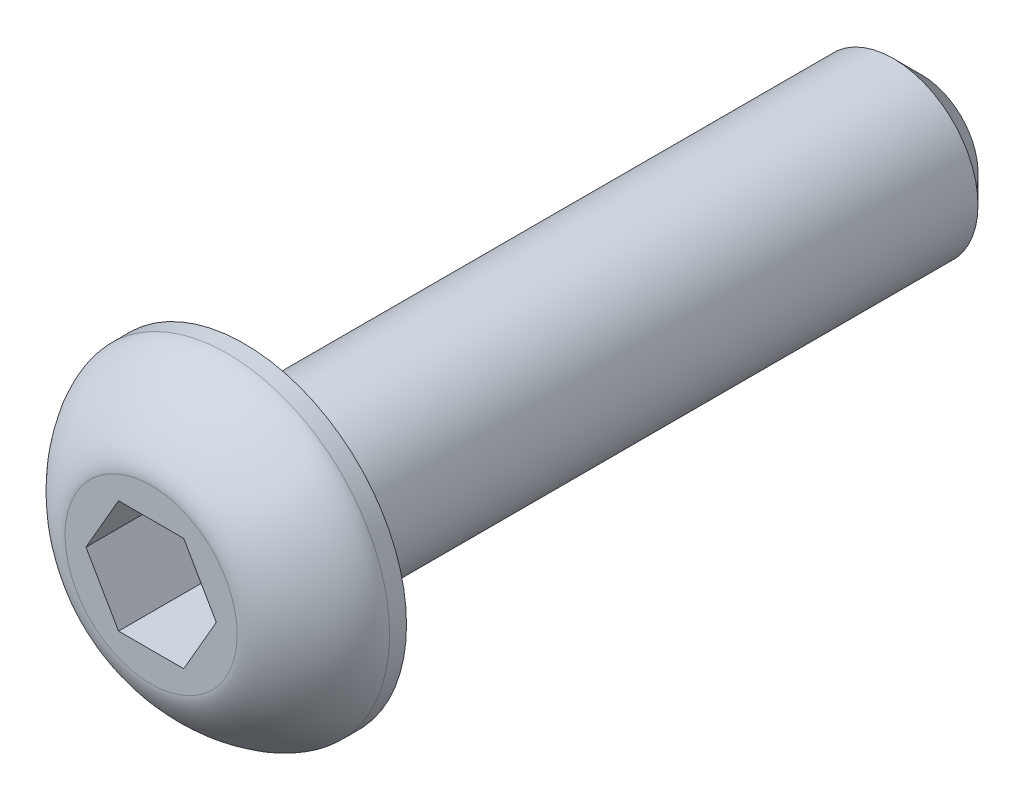
ISO-10303-21;
HEADER;
FILE_DESCRIPTION(('STEP AP214'),'2;1');
FILE_NAME('part.step','',(''),(''),'','','');
FILE_SCHEMA(('AUTOMOTIVE_DESIGN { 1 0 10303 214 1 1 1 1 }'));
ENDSEC;
DATA;
#1=APPLICATION_CONTEXT('core data for automotive mechanical design processes');
#2=APPLICATION_PROTOCOL_DEFINITION('international standard','automotive_design',2000,#1);
#3=PRODUCT_CONTEXT('',#1,'mechanical');
#4=PRODUCT('Part','Part','',(#3));
#5=PRODUCT_RELATED_PRODUCT_CATEGORY('part','',(#4));
#6=PRODUCT_DEFINITION_FORMATION('','',#4);
#7=PRODUCT_DEFINITION_CONTEXT('part definition',#1,'design');
#8=PRODUCT_DEFINITION('design','',#6,#7);
#9=PRODUCT_DEFINITION_SHAPE('','',#8);
#10=(LENGTH_UNIT() NAMED_UNIT(*) SI_UNIT(.MILLI.,.METRE.));
#11=(NAMED_UNIT(*) PLANE_ANGLE_UNIT() SI_UNIT($,.RADIAN.));
#12=(NAMED_UNIT(*) SI_UNIT($,.STERADIAN.) SOLID_ANGLE_UNIT());
#13=UNCERTAINTY_MEASURE_WITH_UNIT(LENGTH_MEASURE(1.E-05),#10,'distance_accuracy_value','');
#14=(GEOMETRIC_REPRESENTATION_CONTEXT(3) GLOBAL_UNCERTAINTY_ASSIGNED_CONTEXT((#13)) GLOBAL_UNIT_ASSIGNED_CONTEXT((#10,
#11,#12)) REPRESENTATION_CONTEXT('',''));
#15=CARTESIAN_POINT('',(0.,0.,0.));
#16=DIRECTION('',(0.,0.,1.));
#17=DIRECTION('',(1.,0.,0.));
#18=AXIS2_PLACEMENT_3D('',#15,#16,#17);
#19=CARTESIAN_POINT('',(0.,0.,1.65));
#20=DIRECTION('',(0.,0.,1.));
#21=DIRECTION('',(1.,0.,0.));
#22=AXIS2_PLACEMENT_3D('',#19,#20,#21);
#23=PLANE('',#22);
#24=CARTESIAN_POINT('',(1.525,0.,1.65));
#25=CARTESIAN_POINT('',(1.525,-0.399244037781713,1.65));
#26=CARTESIAN_POINT('',(1.36064600777329,-0.796029674845719,1.65));
#27=CARTESIAN_POINT('',(0.79602967484567,-1.36064600777326,1.65));
#28=CARTESIAN_POINT('',(0.399244037781751,-1.525,1.65));
#29=CARTESIAN_POINT('',(-0.399244037781746,-1.525,1.65));
#30=CARTESIAN_POINT('',(-0.79602967484569,-1.36064600777324,1.65));
#31=CARTESIAN_POINT('',(-1.36064600777328,-0.796029674845735,1.65));
#32=CARTESIAN_POINT('',(-1.525,-0.399244037781749,1.65));
#33=CARTESIAN_POINT('',(-1.525,0.399244037781749,1.65));
#34=CARTESIAN_POINT('',(-1.36064600777328,0.79602967484569,1.65));
#35=CARTESIAN_POINT('',(-0.796029674845692,1.36064600777328,1.65));
#36=CARTESIAN_POINT('',(-0.399244037781749,1.525,1.65));
#37=CARTESIAN_POINT('',(0.399244037781749,1.525,1.65));
#38=CARTESIAN_POINT('',(0.79602967484573,1.36064600777328,1.65));
#39=CARTESIAN_POINT('',(1.36064600777324,0.796029674845687,1.65));
#40=CARTESIAN_POINT('',(1.525,0.399244037781713,1.65));
#41=CARTESIAN_POINT('',(1.525,0.,1.65));
#42=(BOUNDED_CURVE() B_SPLINE_CURVE(3,(#24,#25,#26,#27,#28,#29,#30,#31,#32,#33,#34,#35,#36,#37,
#38,#39,#40,#41),.UNSPECIFIED.,.T.,.F.) B_SPLINE_CURVE_WITH_KNOTS((4,2,2,2,2,2,2,2,4),(0.,
0.785398163397451,1.5707963267949,2.35619449019235,3.1415926535898,3.92699081698725,
4.7123889803847,5.49778714378214,6.28318530717959),
.UNSPECIFIED.) CURVE() GEOMETRIC_REPRESENTATION_ITEM() RATIONAL_B_SPLINE_CURVE((1.,1.,1.,1.,1.,
1.,1.,1.,1.,1.,1.,1.,1.,1.,1.,1.,1.,1.)) REPRESENTATION_ITEM(''));
#43=CARTESIAN_POINT('',(1.525,0.,1.65));
#44=VERTEX_POINT('',#43);
#45=EDGE_CURVE('E126',#44,#44,#42,.F.);
#46=ORIENTED_EDGE('',*,*,#45,.T.);
#47=EDGE_LOOP('',(#46));
#48=FACE_BOUND('',#47,.T.);
#49=DIRECTION('',(1.,0.,0.));
#50=VECTOR('',#49,1.);
#51=CARTESIAN_POINT('',(0.0995927494460478,1.,1.65));
#52=LINE('',#51,#50);
#53=CARTESIAN_POINT('',(-0.577350269189625,1.,1.65));
#54=VERTEX_POINT('',#53);
#55=CARTESIAN_POINT('',(0.577350269189627,1.,1.65));
#56=VERTEX_POINT('',#55);
#57=EDGE_CURVE('E105',#54,#56,#52,.T.);
#58=ORIENTED_EDGE('',*,*,#57,.T.);
#59=DIRECTION('',(0.5,-0.866025403784439,0.));
#60=VECTOR('',#59,1.);
#61=CARTESIAN_POINT('',(0.915821778507463,0.413750148946983,1.65));
#62=LINE('',#61,#60);
#63=CARTESIAN_POINT('',(1.15470053837925,0.,1.65));
#64=VERTEX_POINT('',#63);
#65=EDGE_CURVE('E102',#56,#64,#62,.T.);
#66=ORIENTED_EDGE('',*,*,#65,.T.);
#67=DIRECTION('',(-0.5,-0.866025403784438,0.));
#68=VECTOR('',#67,1.);
#69=CARTESIAN_POINT('',(0.816229029061414,-0.586249851053017,1.65));
#70=LINE('',#69,#68);
#71=CARTESIAN_POINT('',(0.577350269189625,-1.,1.65));
#72=VERTEX_POINT('',#71);
#73=EDGE_CURVE('E113',#64,#72,#70,.T.);
#74=ORIENTED_EDGE('',*,*,#73,.T.);
#75=DIRECTION('',(-1.,0.,0.));
#76=VECTOR('',#75,1.);
#77=CARTESIAN_POINT('',(-0.0995927494460486,-1.,1.65));
#78=LINE('',#77,#76);
#79=CARTESIAN_POINT('',(-0.577350269189626,-1.,1.65));
#80=VERTEX_POINT('',#79);
#81=EDGE_CURVE('E32',#72,#80,#78,.T.);
#82=ORIENTED_EDGE('',*,*,#81,.T.);
#83=DIRECTION('',(-0.5,0.866025403784439,0.));
#84=VECTOR('',#83,1.);
#85=CARTESIAN_POINT('',(-0.866025403784439,-0.5,1.65));
#86=LINE('',#85,#84);
#87=CARTESIAN_POINT('',(-1.15470053837925,0.,1.65));
#88=VERTEX_POINT('',#87);
#89=EDGE_CURVE('E81',#80,#88,#86,.T.);
#90=ORIENTED_EDGE('',*,*,#89,.T.);
#91=DIRECTION('',(0.5,0.866025403784439,0.));
#92=VECTOR('',#91,1.);
#93=CARTESIAN_POINT('',(-0.816229029061414,0.586249851053016,1.65));
#94=LINE('',#93,#92);
#95=EDGE_CURVE('E108',#88,#54,#94,.T.);
#96=ORIENTED_EDGE('',*,*,#95,.T.);
#97=EDGE_LOOP('',(#58,#66,#74,#82,#90,#96));
#98=FACE_BOUND('',#97,.T.);
#99=ADVANCED_FACE('F17',(#48,#98),#23,.T.);
#100=CARTESIAN_POINT('',(0.,0.,1.65));
#101=DIRECTION('',(0.,0.,-1.));
#102=DIRECTION('',(-1.,0.,0.));
#103=AXIS2_PLACEMENT_3D('',#100,#101,#102);
#104=CYLINDRICAL_SURFACE('',#103,2.875);
#105=CARTESIAN_POINT('',(2.875,0.,0.3));
#106=CARTESIAN_POINT('',(2.875,0.752673185981918,0.3));
#107=CARTESIAN_POINT('',(2.56515230973648,1.50071168208618,0.3));
#108=CARTESIAN_POINT('',(1.50071168208618,2.56515230973648,0.3));
#109=CARTESIAN_POINT('',(0.752673185981985,2.875,0.3));
#110=CARTESIAN_POINT('',(-0.752673185981985,2.875,0.3));
#111=CARTESIAN_POINT('',(-1.50071168208614,2.56515230973651,0.3));
#112=CARTESIAN_POINT('',(-2.56515230973651,1.50071168208614,0.3));
#113=CARTESIAN_POINT('',(-2.875,0.752673185981986,0.3));
#114=CARTESIAN_POINT('',(-2.875,-0.752673185981985,0.3));
#115=CARTESIAN_POINT('',(-2.56515230973647,-1.50071168208618,0.3));
#116=CARTESIAN_POINT('',(-1.50071168208618,-2.56515230973647,0.3));
#117=CARTESIAN_POINT('',(-0.752673185981981,-2.875,0.3));
#118=CARTESIAN_POINT('',(0.75267318598199,-2.875,0.3));
#119=CARTESIAN_POINT('',(1.50071168208611,-2.56515230973653,0.3));
#120=CARTESIAN_POINT('',(2.56515230973652,-1.50071168208613,0.3));
#121=CARTESIAN_POINT('',(2.875,-0.752673185981918,0.3));
#122=CARTESIAN_POINT('',(2.875,0.,0.3));
#123=(BOUNDED_CURVE() B_SPLINE_CURVE(3,(#105,#106,#107,#108,#109,#110,#111,#112,#113,#114,#115,
#116,#117,#118,#119,#120,#121,#122),.UNSPECIFIED.,.T.,.F.) B_SPLINE_CURVE_WITH_KNOTS((4,2,2,2,2,
2,2,2,4),(0.,0.785398163397448,1.5707963267949,2.35619449019234,3.1415926535898,
3.92699081698724,4.71238898038469,5.49778714378214,6.28318530717959),
.UNSPECIFIED.) CURVE() GEOMETRIC_REPRESENTATION_ITEM() RATIONAL_B_SPLINE_CURVE((1.,1.,1.,1.,1.,
1.,1.,1.,1.,1.,1.,1.,1.,1.,1.,1.,1.,1.)) REPRESENTATION_ITEM(''));
#124=CARTESIAN_POINT('',(2.875,0.,0.3));
#125=VERTEX_POINT('',#124);
#126=EDGE_CURVE('E182',#125,#125,#123,.F.);
#127=ORIENTED_EDGE('',*,*,#126,.T.);
#128=EDGE_LOOP('',(#127));
#129=FACE_BOUND('',#128,.T.);
#130=CARTESIAN_POINT('',(0.,0.,0.));
#131=DIRECTION('',(0.,0.,1.));
#132=DIRECTION('',(1.,0.,0.));
#133=AXIS2_PLACEMENT_3D('',#130,#131,#132);
#134=CIRCLE('',#133,2.875);
#135=CARTESIAN_POINT('',(2.875,0.,0.));
#136=VERTEX_POINT('',#135);
#137=EDGE_CURVE('E123',#136,#136,#134,.T.);
#138=ORIENTED_EDGE('',*,*,#137,.T.);
#139=EDGE_LOOP('',(#138));
#140=FACE_BOUND('',#139,.T.);
#141=ADVANCED_FACE('F146',(#129,#140),#104,.T.);
#142=CARTESIAN_POINT('',(0.,0.,0.));
#143=DIRECTION('',(0.,0.,1.));
#144=DIRECTION('',(1.,0.,0.));
#145=AXIS2_PLACEMENT_3D('',#142,#143,#144);
#146=PLANE('',#145);
#147=CARTESIAN_POINT('',(0.,0.,0.));
#148=DIRECTION('',(0.,0.,-1.));
#149=DIRECTION('',(1.,0.,0.));
#150=AXIS2_PLACEMENT_3D('',#147,#148,#149);
#151=CIRCLE('',#150,1.5);
#152=CARTESIAN_POINT('',(1.5,0.,0.));
#153=VERTEX_POINT('',#152);
#154=EDGE_CURVE('E191',#153,#153,#151,.T.);
#155=ORIENTED_EDGE('',*,*,#154,.F.);
#156=EDGE_LOOP('',(#155));
#157=FACE_BOUND('',#156,.T.);
#158=ORIENTED_EDGE('',*,*,#137,.F.);
#159=EDGE_LOOP('',(#158));
#160=FACE_BOUND('',#159,.T.);
#161=ADVANCED_FACE('F149',(#157,#160),#146,.F.);
#162=CARTESIAN_POINT('',(0.915821778507463,0.413750148946983,0.15));
#163=DIRECTION('',(-0.866025403784439,-0.5,0.));
#164=DIRECTION('',(0.5,-0.866025403784439,0.));
#165=AXIS2_PLACEMENT_3D('',#162,#163,#164);
#166=PLANE('',#165);
#167=ORIENTED_EDGE('',*,*,#65,.F.);
#168=DIRECTION('',(0.,0.,1.));
#169=VECTOR('',#168,1.);
#170=CARTESIAN_POINT('',(0.577350269189627,1.,0.15));
#171=LINE('',#170,#169);
#172=CARTESIAN_POINT('',(0.577350269189627,1.,0.15));
#173=VERTEX_POINT('',#172);
#174=EDGE_CURVE('E65',#173,#56,#171,.T.);
#175=ORIENTED_EDGE('',*,*,#174,.F.);
#176=DIRECTION('',(0.5,-0.866025403784439,0.));
#177=VECTOR('',#176,1.);
#178=CARTESIAN_POINT('',(0.915821778507463,0.413750148946983,0.15));
#179=LINE('',#178,#177);
#180=CARTESIAN_POINT('',(1.15470053837925,0.,0.15));
#181=VERTEX_POINT('',#180);
#182=EDGE_CURVE('E116',#173,#181,#179,.T.);
#183=ORIENTED_EDGE('',*,*,#182,.T.);
#184=DIRECTION('',(0.,0.,1.));
#185=VECTOR('',#184,1.);
#186=CARTESIAN_POINT('',(1.15470053837925,0.,0.15));
#187=LINE('',#186,#185);
#188=EDGE_CURVE('E41',#181,#64,#187,.T.);
#189=ORIENTED_EDGE('',*,*,#188,.T.);
#190=EDGE_LOOP('',(#167,#175,#183,#189));
#191=FACE_BOUND('',#190,.T.);
#192=ADVANCED_FACE('F147',(#191),#166,.T.);
#193=CARTESIAN_POINT('',(0.0995927494460478,1.,0.15));
#194=DIRECTION('',(0.,-1.,0.));
#195=DIRECTION('',(1.,0.,0.));
#196=AXIS2_PLACEMENT_3D('',#193,#194,#195);
#197=PLANE('',#196);
#198=ORIENTED_EDGE('',*,*,#57,.F.);
#199=DIRECTION('',(0.,0.,1.));
#200=VECTOR('',#199,1.);
#201=CARTESIAN_POINT('',(-0.577350269189625,1.,0.15));
#202=LINE('',#201,#200);
#203=CARTESIAN_POINT('',(-0.577350269189625,1.,0.15));
#204=VERTEX_POINT('',#203);
#205=EDGE_CURVE('E120',#204,#54,#202,.T.);
#206=ORIENTED_EDGE('',*,*,#205,.F.);
#207=DIRECTION('',(1.,0.,0.));
#208=VECTOR('',#207,1.);
#209=CARTESIAN_POINT('',(0.0995927494460478,1.,0.15));
#210=LINE('',#209,#208);
#211=EDGE_CURVE('E200',#204,#173,#210,.T.);
#212=ORIENTED_EDGE('',*,*,#211,.T.);
#213=ORIENTED_EDGE('',*,*,#174,.T.);
#214=EDGE_LOOP('',(#198,#206,#212,#213));
#215=FACE_BOUND('',#214,.T.);
#216=ADVANCED_FACE('F208',(#215),#197,.T.);
#217=CARTESIAN_POINT('',(-0.816229029061414,0.586249851053016,0.15));
#218=DIRECTION('',(0.866025403784438,-0.5,0.));
#219=DIRECTION('',(0.5,0.866025403784439,0.));
#220=AXIS2_PLACEMENT_3D('',#217,#218,#219);
#221=PLANE('',#220);
#222=ORIENTED_EDGE('',*,*,#95,.F.);
#223=DIRECTION('',(0.,0.,1.));
#224=VECTOR('',#223,1.);
#225=CARTESIAN_POINT('',(-1.15470053837925,0.,0.15));
#226=LINE('',#225,#224);
#227=CARTESIAN_POINT('',(-1.15470053837925,0.,0.15));
#228=VERTEX_POINT('',#227);
#229=EDGE_CURVE('E83',#228,#88,#226,.T.);
#230=ORIENTED_EDGE('',*,*,#229,.F.);
#231=DIRECTION('',(0.5,0.866025403784439,0.));
#232=VECTOR('',#231,1.);
#233=CARTESIAN_POINT('',(-0.816229029061414,0.586249851053016,0.15));
#234=LINE('',#233,#232);
#235=EDGE_CURVE('E94',#228,#204,#234,.T.);
#236=ORIENTED_EDGE('',*,*,#235,.T.);
#237=ORIENTED_EDGE('',*,*,#205,.T.);
#238=EDGE_LOOP('',(#222,#230,#236,#237));
#239=FACE_BOUND('',#238,.T.);
#240=ADVANCED_FACE('F203',(#239),#221,.T.);
#241=CARTESIAN_POINT('',(-0.866025403784439,-0.5,0.15));
#242=DIRECTION('',(0.866025403784439,0.5,0.));
#243=DIRECTION('',(-0.5,0.866025403784439,0.));
#244=AXIS2_PLACEMENT_3D('',#241,#242,#243);
#245=PLANE('',#244);
#246=ORIENTED_EDGE('',*,*,#89,.F.);
#247=DIRECTION('',(0.,0.,1.));
#248=VECTOR('',#247,1.);
#249=CARTESIAN_POINT('',(-0.577350269189626,-1.,0.15));
#250=LINE('',#249,#248);
#251=CARTESIAN_POINT('',(-0.577350269189626,-1.,0.15));
#252=VERTEX_POINT('',#251);
#253=EDGE_CURVE('E76',#252,#80,#250,.T.);
#254=ORIENTED_EDGE('',*,*,#253,.F.);
#255=DIRECTION('',(-0.5,0.866025403784439,0.));
#256=VECTOR('',#255,1.);
#257=CARTESIAN_POINT('',(-0.866025403784439,-0.5,0.15));
#258=LINE('',#257,#256);
#259=EDGE_CURVE('E79',#252,#228,#258,.T.);
#260=ORIENTED_EDGE('',*,*,#259,.T.);
#261=ORIENTED_EDGE('',*,*,#229,.T.);
#262=EDGE_LOOP('',(#246,#254,#260,#261));
#263=FACE_BOUND('',#262,.T.);
#264=ADVANCED_FACE('F78',(#263),#245,.T.);
#265=CARTESIAN_POINT('',(-0.0995927494460486,-1.,0.15));
#266=DIRECTION('',(0.,1.,0.));
#267=DIRECTION('',(-1.,0.,0.));
#268=AXIS2_PLACEMENT_3D('',#265,#266,#267);
#269=PLANE('',#268);
#270=ORIENTED_EDGE('',*,*,#81,.F.);
#271=DIRECTION('',(0.,0.,1.));
#272=VECTOR('',#271,1.);
#273=CARTESIAN_POINT('',(0.577350269189625,-1.,0.15));
#274=LINE('',#273,#272);
#275=CARTESIAN_POINT('',(0.577350269189625,-1.,0.15));
#276=VERTEX_POINT('',#275);
#277=EDGE_CURVE('E84',#276,#72,#274,.T.);
#278=ORIENTED_EDGE('',*,*,#277,.F.);
#279=DIRECTION('',(-1.,0.,0.));
#280=VECTOR('',#279,1.);
#281=CARTESIAN_POINT('',(-0.0995927494460486,-1.,0.15));
#282=LINE('',#281,#280);
#283=EDGE_CURVE('E91',#276,#252,#282,.T.);
#284=ORIENTED_EDGE('',*,*,#283,.T.);
#285=ORIENTED_EDGE('',*,*,#253,.T.);
#286=EDGE_LOOP('',(#270,#278,#284,#285));
#287=FACE_BOUND('',#286,.T.);
#288=ADVANCED_FACE('F96',(#287),#269,.T.);
#289=CARTESIAN_POINT('',(0.816229029061414,-0.586249851053017,0.15));
#290=DIRECTION('',(-0.866025403784438,0.5,0.));
#291=DIRECTION('',(-0.5,-0.866025403784438,0.));
#292=AXIS2_PLACEMENT_3D('',#289,#290,#291);
#293=PLANE('',#292);
#294=ORIENTED_EDGE('',*,*,#73,.F.);
#295=ORIENTED_EDGE('',*,*,#188,.F.);
#296=DIRECTION('',(-0.5,-0.866025403784438,0.));
#297=VECTOR('',#296,1.);
#298=CARTESIAN_POINT('',(0.816229029061414,-0.586249851053017,0.15));
#299=LINE('',#298,#297);
#300=EDGE_CURVE('E97',#181,#276,#299,.T.);
#301=ORIENTED_EDGE('',*,*,#300,.T.);
#302=ORIENTED_EDGE('',*,*,#277,.T.);
#303=EDGE_LOOP('',(#294,#295,#301,#302));
#304=FACE_BOUND('',#303,.T.);
#305=ADVANCED_FACE('F206',(#304),#293,.T.);
#306=CARTESIAN_POINT('',(0.,0.,0.15));
#307=DIRECTION('',(0.,0.,1.));
#308=DIRECTION('',(1.,0.,0.));
#309=AXIS2_PLACEMENT_3D('',#306,#307,#308);
#310=PLANE('',#309);
#311=ORIENTED_EDGE('',*,*,#182,.F.);
#312=ORIENTED_EDGE('',*,*,#211,.F.);
#313=ORIENTED_EDGE('',*,*,#235,.F.);
#314=ORIENTED_EDGE('',*,*,#259,.F.);
#315=ORIENTED_EDGE('',*,*,#283,.F.);
#316=ORIENTED_EDGE('',*,*,#300,.F.);
#317=EDGE_LOOP('',(#311,#312,#313,#314,#315,#316));
#318=FACE_BOUND('',#317,.T.);
#319=ADVANCED_FACE('F90',(#318),#310,.T.);
#320=CARTESIAN_POINT('',(1.525,0.,1.65));
#321=CARTESIAN_POINT('',(1.525,0.399244037781713,1.65));
#322=CARTESIAN_POINT('',(1.36064600777324,0.796029674845687,1.65));
#323=CARTESIAN_POINT('',(0.79602967484573,1.36064600777328,1.65));
#324=CARTESIAN_POINT('',(0.399244037781749,1.525,1.65));
#325=CARTESIAN_POINT('',(-0.399244037781749,1.525,1.65));
#326=CARTESIAN_POINT('',(-0.796029674845692,1.36064600777328,1.65));
#327=CARTESIAN_POINT('',(-1.36064600777328,0.79602967484569,1.65));
#328=CARTESIAN_POINT('',(-1.525,0.399244037781749,1.65));
#329=CARTESIAN_POINT('',(-1.525,-0.399244037781749,1.65));
#330=CARTESIAN_POINT('',(-1.36064600777328,-0.796029674845735,1.65));
#331=CARTESIAN_POINT('',(-0.79602967484569,-1.36064600777324,1.65));
#332=CARTESIAN_POINT('',(-0.399244037781746,-1.525,1.65));
#333=CARTESIAN_POINT('',(0.399244037781751,-1.525,1.65));
#334=CARTESIAN_POINT('',(0.79602967484567,-1.36064600777326,1.65));
#335=CARTESIAN_POINT('',(1.36064600777329,-0.796029674845719,1.65));
#336=CARTESIAN_POINT('',(1.525,-0.399244037781713,1.65));
#337=CARTESIAN_POINT('',(1.525,0.,1.65));
#338=CARTESIAN_POINT('',(2.875,0.,1.65));
#339=CARTESIAN_POINT('',(2.87499999999983,0.752673185981917,1.64999999999987));
#340=CARTESIAN_POINT('',(2.56515230973643,1.50071168208613,1.65));
#341=CARTESIAN_POINT('',(1.50071168208622,2.56515230973651,1.65));
#342=CARTESIAN_POINT('',(0.752673185981985,2.875,1.65));
#343=CARTESIAN_POINT('',(-0.752673185981985,2.875,1.65));
#344=CARTESIAN_POINT('',(-1.50071168208614,2.56515230973651,1.65));
#345=CARTESIAN_POINT('',(-2.56515230973651,1.50071168208613,1.65));
#346=CARTESIAN_POINT('',(-2.875,0.752673185981985,1.65));
#347=CARTESIAN_POINT('',(-2.875,-0.752673185981985,1.65));
#348=CARTESIAN_POINT('',(-2.56515230973651,-1.50071168208622,1.65));
#349=CARTESIAN_POINT('',(-1.50071168208613,-2.56515230973643,1.65));
#350=CARTESIAN_POINT('',(-0.75267318598198,-2.875,1.65));
#351=CARTESIAN_POINT('',(0.752673185981989,-2.875,1.65));
#352=CARTESIAN_POINT('',(1.50071168208612,-2.56515230973653,1.64999999999995));
#353=CARTESIAN_POINT('',(2.56515230973652,-1.50071168208613,1.65000000000004));
#354=CARTESIAN_POINT('',(2.87500000000017,-0.752673185981917,1.65000000000013));
#355=CARTESIAN_POINT('',(2.875,0.,1.65));
#356=CARTESIAN_POINT('',(2.875,0.,0.3));
#357=CARTESIAN_POINT('',(2.875,0.752673185981918,0.3));
#358=CARTESIAN_POINT('',(2.56515230973648,1.50071168208618,0.3));
#359=CARTESIAN_POINT('',(1.50071168208618,2.56515230973648,0.3));
#360=CARTESIAN_POINT('',(0.752673185981985,2.875,0.3));
#361=CARTESIAN_POINT('',(-0.752673185981985,2.875,0.3));
#362=CARTESIAN_POINT('',(-1.50071168208614,2.56515230973651,0.3));
#363=CARTESIAN_POINT('',(-2.56515230973651,1.50071168208614,0.3));
#364=CARTESIAN_POINT('',(-2.875,0.752673185981986,0.3));
#365=CARTESIAN_POINT('',(-2.875,-0.752673185981985,0.3));
#366=CARTESIAN_POINT('',(-2.56515230973647,-1.50071168208618,0.3));
#367=CARTESIAN_POINT('',(-1.50071168208618,-2.56515230973647,0.3));
#368=CARTESIAN_POINT('',(-0.752673185981981,-2.875,0.3));
#369=CARTESIAN_POINT('',(0.75267318598199,-2.875,0.3));
#370=CARTESIAN_POINT('',(1.50071168208611,-2.56515230973653,0.3));
#371=CARTESIAN_POINT('',(2.56515230973652,-1.50071168208613,0.3));
#372=CARTESIAN_POINT('',(2.875,-0.752673185981918,0.3));
#373=CARTESIAN_POINT('',(2.875,0.,0.3));
#374=(BOUNDED_SURFACE() B_SPLINE_SURFACE(2,3,((#320,#321,#322,#323,#324,#325,#326,#327,#328,
#329,#330,#331,#332,#333,#334,#335,#336,#337),(#338,#339,#340,#341,#342,#343,#344,#345,#346,
#347,#348,#349,#350,#351,#352,#353,#354,#355),(#356,#357,#358,#359,#360,#361,#362,#363,#364,
#365,#366,#367,#368,#369,#370,#371,#372,#373)),.UNSPECIFIED.,.F.,.T.,
.F.) B_SPLINE_SURFACE_WITH_KNOTS((3,3),(4,2,2,2,2,2,2,2,4),(0.,1.),(0.,0.785398163397448,
1.5707963267949,2.35619449019234,3.1415926535898,3.92699081698724,4.71238898038469,
5.49778714378214,6.28318530717959),
.UNSPECIFIED.) GEOMETRIC_REPRESENTATION_ITEM() RATIONAL_B_SPLINE_SURFACE(((1.,1.,1.,1.,1.,1.,1.,
1.,1.,1.,1.,1.,1.,1.,1.,1.,1.,1.),(0.333333333333334,0.333333333333334,0.333333333333334,
0.333333333333334,0.333333333333334,0.333333333333334,0.333333333333334,0.333333333333334,
0.333333333333334,0.333333333333334,0.333333333333334,0.333333333333334,0.333333333333334,
0.333333333333334,0.333333333333334,0.333333333333334,0.333333333333334,0.333333333333334),(1.,
1.,1.,1.,1.,1.,1.,1.,1.,1.,1.,1.,1.,1.,1.,1.,1.,1.))) REPRESENTATION_ITEM('') SURFACE());
#375=ORIENTED_EDGE('',*,*,#126,.F.);
#376=EDGE_LOOP('',(#375));
#377=FACE_BOUND('',#376,.T.);
#378=ORIENTED_EDGE('',*,*,#45,.F.);
#379=EDGE_LOOP('',(#378));
#380=FACE_BOUND('',#379,.T.);
#381=ADVANCED_FACE('F157',(#377,#380),#374,.T.);
#382=CARTESIAN_POINT('',(0.,0.,-12.));
#383=DIRECTION('',(0.,0.,1.));
#384=DIRECTION('',(1.,0.,0.));
#385=AXIS2_PLACEMENT_3D('',#382,#383,#384);
#386=CYLINDRICAL_SURFACE('',#385,1.5);
#387=CARTESIAN_POINT('',(0.,0.,-11.5));
#388=DIRECTION('',(0.,0.,-1.));
#389=DIRECTION('',(-1.,0.,0.));
#390=AXIS2_PLACEMENT_3D('',#387,#388,#389);
#391=CIRCLE('',#390,1.5);
#392=CARTESIAN_POINT('',(-1.5,0.,-11.5));
#393=VERTEX_POINT('',#392);
#394=EDGE_CURVE('E11',#393,#393,#391,.F.);
#395=ORIENTED_EDGE('',*,*,#394,.T.);
#396=EDGE_LOOP('',(#395));
#397=FACE_BOUND('',#396,.T.);
#398=ORIENTED_EDGE('',*,*,#154,.T.);
#399=EDGE_LOOP('',(#398));
#400=FACE_BOUND('',#399,.T.);
#401=ADVANCED_FACE('F227',(#397,#400),#386,.T.);
#402=CARTESIAN_POINT('',(0.,0.,-12.));
#403=DIRECTION('',(0.,0.,-1.));
#404=DIRECTION('',(1.,0.,0.));
#405=AXIS2_PLACEMENT_3D('',#402,#403,#404);
#406=PLANE('',#405);
#407=CARTESIAN_POINT('',(0.,0.,-12.));
#408=DIRECTION('',(0.,0.,-1.));
#409=DIRECTION('',(-1.,0.,0.));
#410=AXIS2_PLACEMENT_3D('',#407,#408,#409);
#411=CIRCLE('',#410,1.);
#412=CARTESIAN_POINT('',(-1.,0.,-12.));
#413=VERTEX_POINT('',#412);
#414=EDGE_CURVE('E25',#413,#413,#411,.T.);
#415=ORIENTED_EDGE('',*,*,#414,.T.);
#416=EDGE_LOOP('',(#415));
#417=FACE_BOUND('',#416,.T.);
#418=ADVANCED_FACE('F230',(#417),#406,.T.);
#419=CARTESIAN_POINT('',(0.,0.,-12.));
#420=DIRECTION('',(0.,0.,1.));
#421=DIRECTION('',(1.,0.,0.));
#422=AXIS2_PLACEMENT_3D('',#419,#420,#421);
#423=CONICAL_SURFACE('',#422,1.,0.785398163397448);
#424=ORIENTED_EDGE('',*,*,#394,.F.);
#425=EDGE_LOOP('',(#424));
#426=FACE_BOUND('',#425,.T.);
#427=ORIENTED_EDGE('',*,*,#414,.F.);
#428=EDGE_LOOP('',(#427));
#429=FACE_BOUND('',#428,.T.);
#430=ADVANCED_FACE('F19',(#426,#429),#423,.T.);
#431=CLOSED_SHELL('',(#99,#141,#161,#192,#216,#240,#264,#288,#305,#319,#381,#401,#418,#430));
#432=MANIFOLD_SOLID_BREP('B1',#431);
#433=ADVANCED_BREP_SHAPE_REPRESENTATION('',(#18,#432),#14);
#434=SHAPE_DEFINITION_REPRESENTATION(#9,#433);
ENDSEC;
END-ISO-10303-21;
